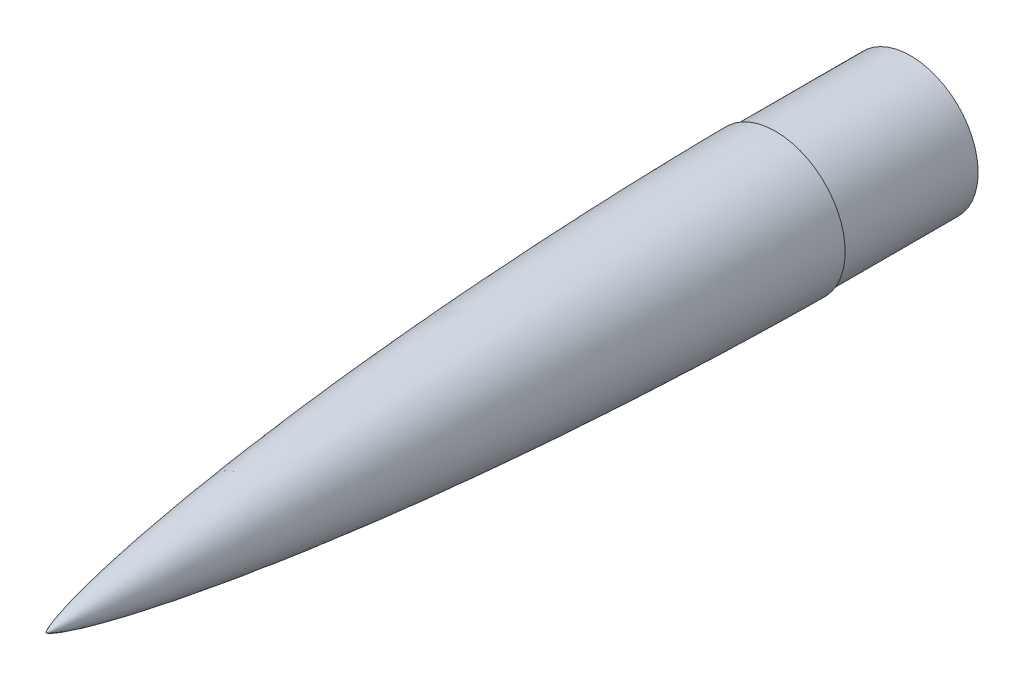
ISO-10303-21;
HEADER;
FILE_DESCRIPTION(('STEP AP214'),'2;1');
FILE_NAME('part.step','',(''),(''),'','','');
FILE_SCHEMA(('AUTOMOTIVE_DESIGN { 1 0 10303 214 1 1 1 1 }'));
ENDSEC;
DATA;
#1=APPLICATION_CONTEXT('core data for automotive mechanical design processes');
#2=APPLICATION_PROTOCOL_DEFINITION('international standard','automotive_design',2000,#1);
#3=PRODUCT_CONTEXT('',#1,'mechanical');
#4=PRODUCT('Part','Part','',(#3));
#5=PRODUCT_RELATED_PRODUCT_CATEGORY('part','',(#4));
#6=PRODUCT_DEFINITION_FORMATION('','',#4);
#7=PRODUCT_DEFINITION_CONTEXT('part definition',#1,'design');
#8=PRODUCT_DEFINITION('design','',#6,#7);
#9=PRODUCT_DEFINITION_SHAPE('','',#8);
#10=(LENGTH_UNIT() NAMED_UNIT(*) SI_UNIT(.MILLI.,.METRE.));
#11=(NAMED_UNIT(*) PLANE_ANGLE_UNIT() SI_UNIT($,.RADIAN.));
#12=(NAMED_UNIT(*) SI_UNIT($,.STERADIAN.) SOLID_ANGLE_UNIT());
#13=UNCERTAINTY_MEASURE_WITH_UNIT(LENGTH_MEASURE(1.E-05),#10,'distance_accuracy_value','');
#14=(GEOMETRIC_REPRESENTATION_CONTEXT(3) GLOBAL_UNCERTAINTY_ASSIGNED_CONTEXT((#13)) GLOBAL_UNIT_ASSIGNED_CONTEXT((#10,
#11,#12)) REPRESENTATION_CONTEXT('',''));
#15=CARTESIAN_POINT('',(0.,0.,0.));
#16=DIRECTION('',(0.,0.,1.));
#17=DIRECTION('',(1.,0.,0.));
#18=AXIS2_PLACEMENT_3D('',#15,#16,#17);
#19=CARTESIAN_POINT('',(0.,65.405,-685.8));
#20=CARTESIAN_POINT('',(0.,65.405,-684.485121272052));
#21=CARTESIAN_POINT('',(0.,65.3935205793124,-681.855376015666));
#22=CARTESIAN_POINT('',(0.,65.3735303170833,-677.910796563461));
#23=CARTESIAN_POINT('',(0.,65.3316998729456,-672.651436745629));
#24=CARTESIAN_POINT('',(0.,65.2692221043456,-666.077341219304));
#25=CARTESIAN_POINT('',(0.,65.1767470561121,-658.188600750671));
#26=CARTESIAN_POINT('',(0.,65.0474827604112,-648.94209479533));
#27=CARTESIAN_POINT('',(0.,64.7840244466443,-632.992707932571));
#28=CARTESIAN_POINT('',(0.,64.402473986804,-614.328747749962));
#29=CARTESIAN_POINT('',(0.,63.8726305660593,-592.951178627487));
#30=CARTESIAN_POINT('',(0.,63.0009991094314,-563.561033109567));
#31=CARTESIAN_POINT('',(0.,62.0623088945785,-536.847380859153));
#32=CARTESIAN_POINT('',(0.,60.9782163749543,-510.139226829273));
#33=CARTESIAN_POINT('',(0.,59.5005574289602,-478.097232785945));
#34=CARTESIAN_POINT('',(0.,57.8440341458656,-446.063808120787));
#35=CARTESIAN_POINT('',(0.,55.6441802473817,-408.706059524546));
#36=CARTESIAN_POINT('',(0.,52.7471290580236,-366.035691483811));
#37=CARTESIAN_POINT('',(0.,49.4446728295142,-323.394730687329));
#38=CARTESIAN_POINT('',(0.,45.7076004696462,-280.789499898449));
#39=CARTESIAN_POINT('',(0.,41.4956600630884,-238.228469901065));
#40=CARTESIAN_POINT('',(0.,36.754430002566,-195.722819830797));
#41=CARTESIAN_POINT('',(0.,31.4017407102855,-153.289449921695));
#42=CARTESIAN_POINT('',(0.,25.4687603314321,-112.040265782445));
#43=CARTESIAN_POINT('',(0.,19.5038981612316,-76.2047078542628));
#44=CARTESIAN_POINT('',(0.,13.9525085959273,-47.6298391838727));
#45=CARTESIAN_POINT('',(0.,9.38962699765855,-27.7350056304969));
#46=CARTESIAN_POINT('',(0.,6.31662131154601,-16.2109428625035));
#47=CARTESIAN_POINT('',(0.,4.18194651098269,-9.31832052248213));
#48=CARTESIAN_POINT('',(0.,2.79784507385194,-5.4483382524516));
#49=CARTESIAN_POINT('',(0.,1.91750850209447,-3.29300440985363));
#50=CARTESIAN_POINT('',(0.,1.37696095382615,-2.12335210684411));
#51=CARTESIAN_POINT('',(0.,1.04703872782662,-1.4784356818174));
#52=CARTESIAN_POINT('',(0.,0.822025620675648,-1.07155708893394));
#53=CARTESIAN_POINT('',(0.,0.67770029633276,-0.827068410392984));
#54=CARTESIAN_POINT('',(0.,0.546173066213784,-0.619898716914429));
#55=CARTESIAN_POINT('',(0.,0.428627231545043,-0.44979484773894));
#56=CARTESIAN_POINT('',(0.,0.349869153991174,-0.342466914738959));
#57=CARTESIAN_POINT('',(0.,0.276487255814619,-0.249756901936484));
#58=CARTESIAN_POINT('',(0.,0.208876089667496,-0.171483687558604));
#59=CARTESIAN_POINT('',(0.,0.147595052902646,-0.107673788922353));
#60=CARTESIAN_POINT('',(0.,0.10038741614022,-0.0636410587873789));
#61=CARTESIAN_POINT('',(0.,0.057075747949246,-0.0295232944577308));
#62=CARTESIAN_POINT('',(0.,0.0259041000770289,-0.00934966268541325));
#63=CARTESIAN_POINT('',(0.,0.00888026648789547,-0.00253064911690683));
#64=CARTESIAN_POINT('',(0.,0.,0.));
#65=B_SPLINE_CURVE_WITH_KNOTS('',4,(#19,#20,#21,#22,#23,#24,#25,#26,#27,#28,#29,#30,#31,#32,#33,
#34,#35,#36,#37,#38,#39,#40,#41,#42,#43,#44,#45,#46,#47,#48,#49,#50,#51,#52,#53,#54,#55,#56,#57,
#58,#59,#60,#61,#62,#63,#64),.UNSPECIFIED.,.F.,.F.,(5,1,1,1,1,1,1,1,1,1,1,1,1,1,1,1,1,1,1,1,1,1,
1,1,1,1,1,1,1,1,1,1,1,1,1,1,1,1,1,1,1,1,5),(0.,0.0076133259681177,0.0152266519362353,
0.0228399779043529,0.0304533038724706,0.0456799558087058,0.0609066077449411,0.076383683622995,
0.122814911257156,0.153768987695562,0.184723064133968,0.246630947086405,0.277585037404755,
0.308539127723105,0.370447211764446,0.432355342958083,0.494263450690412,0.556171550507095,
0.618079641608188,0.679987764671959,0.741895958561139,0.803803741959616,0.865712233170095,
0.921268011395524,0.952222444156783,0.972320807088128,0.983875785687456,0.990309813622096,
0.993990407520034,0.996111260196595,0.997352115754301,0.997768050198311,0.99818398464232,
0.998803112901376,0.998995768891883,0.999188424882391,0.999381080872898,0.999573736863405,
0.999680302647554,0.999786868431703,0.999893434215851,0.999946717107926,1.),.UNSPECIFIED.);
#66=CARTESIAN_POINT('',(0.,0.,0.));
#67=DIRECTION('',(0.,0.,1.));
#68=AXIS1_PLACEMENT('',#66,#67);
#69=SURFACE_OF_REVOLUTION('',#65,#68);
#70=CARTESIAN_POINT('',(0.,0.,0.));
#71=VERTEX_POINT('',#70);
#72=VERTEX_LOOP('',#71);
#73=FACE_BOUND('',#72,.T.);
#74=CARTESIAN_POINT('',(0.,0.,-685.8));
#75=DIRECTION('',(0.,0.,1.));
#76=DIRECTION('',(1.,0.,0.));
#77=AXIS2_PLACEMENT_3D('',#74,#75,#76);
#78=CIRCLE('',#77,65.405);
#79=CARTESIAN_POINT('',(65.405,0.,-685.8));
#80=VERTEX_POINT('',#79);
#81=EDGE_CURVE('E53',#80,#80,#78,.T.);
#82=ORIENTED_EDGE('',*,*,#81,.T.);
#83=EDGE_LOOP('',(#82));
#84=FACE_BOUND('',#83,.T.);
#85=ADVANCED_FACE('F45',(#73,#84),#69,.T.);
#86=CARTESIAN_POINT('',(0.,0.,-685.8));
#87=DIRECTION('',(0.,0.,1.));
#88=DIRECTION('',(1.,0.,0.));
#89=AXIS2_PLACEMENT_3D('',#86,#87,#88);
#90=PLANE('',#89);
#91=CARTESIAN_POINT('',(0.,0.,-685.8));
#92=DIRECTION('',(0.,0.,-1.));
#93=DIRECTION('',(-1.,0.,0.));
#94=AXIS2_PLACEMENT_3D('',#91,#92,#93);
#95=CIRCLE('',#94,63.373);
#96=CARTESIAN_POINT('',(-63.373,0.,-685.8));
#97=VERTEX_POINT('',#96);
#98=EDGE_CURVE('E86',#97,#97,#95,.T.);
#99=ORIENTED_EDGE('',*,*,#98,.F.);
#100=EDGE_LOOP('',(#99));
#101=FACE_BOUND('',#100,.T.);
#102=ORIENTED_EDGE('',*,*,#81,.F.);
#103=EDGE_LOOP('',(#102));
#104=FACE_BOUND('',#103,.T.);
#105=ADVANCED_FACE('F74',(#101,#104),#90,.F.);
#106=CARTESIAN_POINT('',(0.,0.,-812.8));
#107=DIRECTION('',(0.,0.,-1.));
#108=DIRECTION('',(-1.,0.,0.));
#109=AXIS2_PLACEMENT_3D('',#106,#107,#108);
#110=PLANE('',#109);
#111=CARTESIAN_POINT('',(0.,0.,-812.8));
#112=DIRECTION('',(0.,0.,-1.));
#113=DIRECTION('',(-1.,0.,0.));
#114=AXIS2_PLACEMENT_3D('',#111,#112,#113);
#115=CIRCLE('',#114,63.373);
#116=CARTESIAN_POINT('',(-63.373,0.,-812.8));
#117=VERTEX_POINT('',#116);
#118=EDGE_CURVE('E84',#117,#117,#115,.T.);
#119=ORIENTED_EDGE('',*,*,#118,.T.);
#120=EDGE_LOOP('',(#119));
#121=FACE_BOUND('',#120,.T.);
#122=CARTESIAN_POINT('',(0.,0.,-812.8));
#123=DIRECTION('',(0.,0.,-1.));
#124=DIRECTION('',(-1.,0.,0.));
#125=AXIS2_PLACEMENT_3D('',#122,#123,#124);
#126=CIRCLE('',#125,61.595);
#127=CARTESIAN_POINT('',(-61.595,0.,-812.8));
#128=VERTEX_POINT('',#127);
#129=EDGE_CURVE('E104',#128,#128,#126,.T.);
#130=ORIENTED_EDGE('',*,*,#129,.F.);
#131=EDGE_LOOP('',(#130));
#132=FACE_BOUND('',#131,.T.);
#133=ADVANCED_FACE('F78',(#121,#132),#110,.T.);
#134=CARTESIAN_POINT('',(0.,0.,-812.8));
#135=DIRECTION('',(0.,0.,1.));
#136=DIRECTION('',(1.,0.,0.));
#137=AXIS2_PLACEMENT_3D('',#134,#135,#136);
#138=CYLINDRICAL_SURFACE('',#137,63.373);
#139=ORIENTED_EDGE('',*,*,#118,.F.);
#140=EDGE_LOOP('',(#139));
#141=FACE_BOUND('',#140,.T.);
#142=ORIENTED_EDGE('',*,*,#98,.T.);
#143=EDGE_LOOP('',(#142));
#144=FACE_BOUND('',#143,.T.);
#145=ADVANCED_FACE('F67',(#141,#144),#138,.T.);
#146=CARTESIAN_POINT('',(0.,0.,-812.8));
#147=DIRECTION('',(0.,0.,1.));
#148=DIRECTION('',(1.,0.,0.));
#149=AXIS2_PLACEMENT_3D('',#146,#147,#148);
#150=CYLINDRICAL_SURFACE('',#149,61.595);
#151=ORIENTED_EDGE('',*,*,#129,.T.);
#152=EDGE_LOOP('',(#151));
#153=FACE_BOUND('',#152,.T.);
#154=CARTESIAN_POINT('',(0.,0.,-585.045090957775));
#155=DIRECTION('',(0.,0.,1.));
#156=DIRECTION('',(1.,0.,0.));
#157=AXIS2_PLACEMENT_3D('',#154,#155,#156);
#158=CIRCLE('',#157,61.595);
#159=CARTESIAN_POINT('',(61.595,0.,-585.045090957775));
#160=VERTEX_POINT('',#159);
#161=EDGE_CURVE('E11',#160,#160,#158,.T.);
#162=ORIENTED_EDGE('',*,*,#161,.T.);
#163=EDGE_LOOP('',(#162));
#164=FACE_BOUND('',#163,.T.);
#165=ADVANCED_FACE('F61',(#153,#164),#150,.F.);
#166=CARTESIAN_POINT('',(0.,65.405,-685.8));
#167=CARTESIAN_POINT('',(0.,65.405,-684.485121272052));
#168=CARTESIAN_POINT('',(0.,65.3935205793124,-681.855376015666));
#169=CARTESIAN_POINT('',(0.,65.3735303170833,-677.910796563461));
#170=CARTESIAN_POINT('',(0.,65.3316998729456,-672.651436745629));
#171=CARTESIAN_POINT('',(0.,65.2692221043456,-666.077341219304));
#172=CARTESIAN_POINT('',(0.,65.1767470561121,-658.188600750671));
#173=CARTESIAN_POINT('',(0.,65.0474827604112,-648.94209479533));
#174=CARTESIAN_POINT('',(0.,64.7840244466443,-632.992707932571));
#175=CARTESIAN_POINT('',(0.,64.402473986804,-614.328747749962));
#176=CARTESIAN_POINT('',(0.,63.8726305660593,-592.951178627487));
#177=CARTESIAN_POINT('',(0.,63.0009991094314,-563.561033109567));
#178=CARTESIAN_POINT('',(0.,62.0623088945785,-536.847380859153));
#179=CARTESIAN_POINT('',(0.,60.9782163749543,-510.139226829273));
#180=CARTESIAN_POINT('',(0.,59.5005574289602,-478.097232785945));
#181=CARTESIAN_POINT('',(0.,57.8440341458656,-446.063808120787));
#182=CARTESIAN_POINT('',(0.,55.6441802473817,-408.706059524546));
#183=CARTESIAN_POINT('',(0.,52.7471290580236,-366.035691483811));
#184=CARTESIAN_POINT('',(0.,49.4446728295142,-323.394730687329));
#185=CARTESIAN_POINT('',(0.,45.7076004696462,-280.789499898449));
#186=CARTESIAN_POINT('',(0.,41.4956600630884,-238.228469901065));
#187=CARTESIAN_POINT('',(0.,36.754430002566,-195.722819830797));
#188=CARTESIAN_POINT('',(0.,31.4017407102855,-153.289449921695));
#189=CARTESIAN_POINT('',(0.,25.4687603314321,-112.040265782445));
#190=CARTESIAN_POINT('',(0.,19.5038981612316,-76.2047078542628));
#191=CARTESIAN_POINT('',(0.,13.9525085959273,-47.6298391838727));
#192=CARTESIAN_POINT('',(0.,9.38962699765855,-27.7350056304969));
#193=CARTESIAN_POINT('',(0.,6.31662131154601,-16.2109428625035));
#194=CARTESIAN_POINT('',(0.,4.18194651098269,-9.31832052248213));
#195=CARTESIAN_POINT('',(0.,2.88659014141926,-5.69647168315602));
#196=CARTESIAN_POINT('',(0.,2.19649833995581,-3.97990414284564));
#197=CARTESIAN_POINT('',(0.,1.90448070487305,-3.30157721097625));
#198=CARTESIAN_POINT('',(0.,1.86347318877834,-3.20726411507432));
#199=B_SPLINE_CURVE_WITH_KNOTS('',4,(#166,#167,#168,#169,#170,#171,#172,#173,#174,#175,#176,
#177,#178,#179,#180,#181,#182,#183,#184,#185,#186,#187,#188,#189,#190,#191,#192,#193,#194,#195,
#196,#197,#198),.UNSPECIFIED.,.F.,.F.,(5,1,1,1,1,1,1,1,1,1,1,1,1,1,1,1,1,1,1,1,1,1,1,1,1,1,1,1,
1,5),(0.,0.0076133259681177,0.0152266519362353,0.0228399779043529,0.0304533038724706,
0.0456799558087058,0.0609066077449411,0.076383683622995,0.122814911257156,0.153768987695562,
0.184723064133968,0.246630947086405,0.277585037404755,0.308539127723105,0.370447211764446,
0.432355342958083,0.494263450690412,0.556171550507095,0.618079641608188,0.679987764671959,
0.741895958561139,0.803803741959616,0.865712233170095,0.921268011395524,0.952222444156783,
0.972320807088128,0.983875785687456,0.990309813622096,0.993990407520034,0.994585876787598),.UNSPECIFIED.);
#200=CARTESIAN_POINT('',(0.,0.,0.));
#201=DIRECTION('',(0.,0.,1.));
#202=AXIS1_PLACEMENT('',#200,#201);
#203=SURFACE_OF_REVOLUTION('',#199,#202);
#204=OFFSET_SURFACE('',#203,-2.03199999999998,.F.);
#205=ORIENTED_EDGE('',*,*,#161,.F.);
#206=EDGE_LOOP('',(#205));
#207=FACE_BOUND('',#206,.T.);
#208=CARTESIAN_POINT('',(0.,0.,-4.01750585351048));
#209=VERTEX_POINT('',#208);
#210=VERTEX_LOOP('',#209);
#211=FACE_BOUND('',#210,.T.);
#212=ADVANCED_FACE('F59',(#207,#211),#204,.F.);
#213=CLOSED_SHELL('',(#85,#105,#133,#145,#165,#212));
#214=MANIFOLD_SOLID_BREP('B2',#213);
#215=ADVANCED_BREP_SHAPE_REPRESENTATION('',(#18,#214),#14);
#216=SHAPE_DEFINITION_REPRESENTATION(#9,#215);
ENDSEC;
END-ISO-10303-21;
